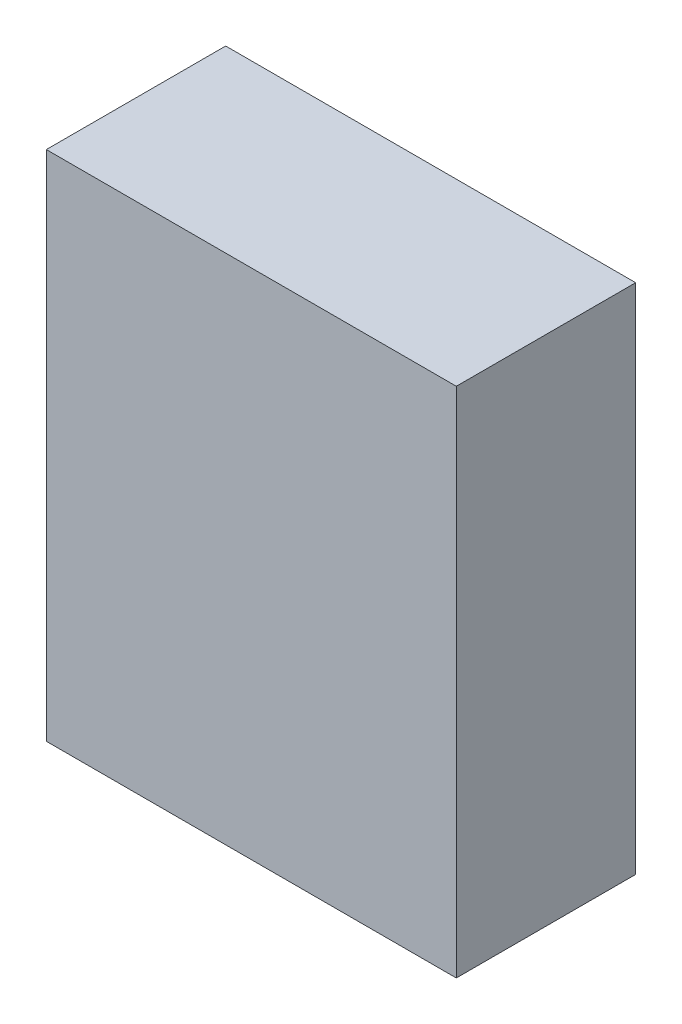
ISO-10303-21;
HEADER;
FILE_DESCRIPTION(('STEP AP214'),'2;1');
FILE_NAME('part.step','',(''),(''),'','','');
FILE_SCHEMA(('AUTOMOTIVE_DESIGN { 1 0 10303 214 1 1 1 1 }'));
ENDSEC;
DATA;
#1=APPLICATION_CONTEXT('core data for automotive mechanical design processes');
#2=APPLICATION_PROTOCOL_DEFINITION('international standard','automotive_design',2000,#1);
#3=PRODUCT_CONTEXT('',#1,'mechanical');
#4=PRODUCT('Part','Part','',(#3));
#5=PRODUCT_RELATED_PRODUCT_CATEGORY('part','',(#4));
#6=PRODUCT_DEFINITION_FORMATION('','',#4);
#7=PRODUCT_DEFINITION_CONTEXT('part definition',#1,'design');
#8=PRODUCT_DEFINITION('design','',#6,#7);
#9=PRODUCT_DEFINITION_SHAPE('','',#8);
#10=(LENGTH_UNIT() NAMED_UNIT(*) SI_UNIT(.MILLI.,.METRE.));
#11=(NAMED_UNIT(*) PLANE_ANGLE_UNIT() SI_UNIT($,.RADIAN.));
#12=(NAMED_UNIT(*) SI_UNIT($,.STERADIAN.) SOLID_ANGLE_UNIT());
#13=UNCERTAINTY_MEASURE_WITH_UNIT(LENGTH_MEASURE(1.E-05),#10,'distance_accuracy_value','');
#14=(GEOMETRIC_REPRESENTATION_CONTEXT(3) GLOBAL_UNCERTAINTY_ASSIGNED_CONTEXT((#13)) GLOBAL_UNIT_ASSIGNED_CONTEXT((#10,
#11,#12)) REPRESENTATION_CONTEXT('',''));
#15=CARTESIAN_POINT('',(0.,0.,0.));
#16=DIRECTION('',(0.,0.,1.));
#17=DIRECTION('',(1.,0.,0.));
#18=AXIS2_PLACEMENT_3D('',#15,#16,#17);
#19=CARTESIAN_POINT('',(2.00000108,-2.50000008,1.74999904));
#20=DIRECTION('',(0.,0.,1.));
#21=DIRECTION('',(1.,0.,0.));
#22=AXIS2_PLACEMENT_3D('',#19,#20,#21);
#23=PLANE('',#22);
#24=DIRECTION('',(0.,1.,0.));
#25=VECTOR('',#24,1.);
#26=CARTESIAN_POINT('',(-2.00000108,-2.50000008,1.74999904));
#27=LINE('',#26,#25);
#28=CARTESIAN_POINT('',(-2.00000108,-2.50000008,1.74999904));
#29=VERTEX_POINT('',#28);
#30=CARTESIAN_POINT('',(-2.00000108,2.50000008,1.74999904));
#31=VERTEX_POINT('',#30);
#32=EDGE_CURVE('E53',#29,#31,#27,.T.);
#33=ORIENTED_EDGE('',*,*,#32,.F.);
#34=DIRECTION('',(1.,0.,0.));
#35=VECTOR('',#34,1.);
#36=CARTESIAN_POINT('',(2.00000108,-2.50000008,1.74999904));
#37=LINE('',#36,#35);
#38=CARTESIAN_POINT('',(2.00000108,-2.50000008,1.74999904));
#39=VERTEX_POINT('',#38);
#40=EDGE_CURVE('E68',#39,#29,#37,.F.);
#41=ORIENTED_EDGE('',*,*,#40,.F.);
#42=DIRECTION('',(0.,1.,0.));
#43=VECTOR('',#42,1.);
#44=CARTESIAN_POINT('',(2.00000108,2.50000008,1.74999904));
#45=LINE('',#44,#43);
#46=CARTESIAN_POINT('',(2.00000108,2.50000008,1.74999904));
#47=VERTEX_POINT('',#46);
#48=EDGE_CURVE('E20',#47,#39,#45,.F.);
#49=ORIENTED_EDGE('',*,*,#48,.F.);
#50=DIRECTION('',(1.,0.,0.));
#51=VECTOR('',#50,1.);
#52=CARTESIAN_POINT('',(-2.00000108,2.50000008,1.74999904));
#53=LINE('',#52,#51);
#54=EDGE_CURVE('E58',#31,#47,#53,.T.);
#55=ORIENTED_EDGE('',*,*,#54,.F.);
#56=EDGE_LOOP('',(#33,#41,#49,#55));
#57=FACE_BOUND('',#56,.T.);
#58=ADVANCED_FACE('F17',(#57),#23,.T.);
#59=CARTESIAN_POINT('',(2.00000108,2.50000008,0.));
#60=DIRECTION('',(1.,0.,0.));
#61=DIRECTION('',(0.,0.,-1.));
#62=AXIS2_PLACEMENT_3D('',#59,#60,#61);
#63=PLANE('',#62);
#64=DIRECTION('',(0.,0.,-1.));
#65=VECTOR('',#64,1.);
#66=CARTESIAN_POINT('',(2.00000108,-2.50000008,0.));
#67=LINE('',#66,#65);
#68=CARTESIAN_POINT('',(2.00000108,-2.50000008,0.));
#69=VERTEX_POINT('',#68);
#70=EDGE_CURVE('E79',#69,#39,#67,.F.);
#71=ORIENTED_EDGE('',*,*,#70,.F.);
#72=DIRECTION('',(0.,1.,0.));
#73=VECTOR('',#72,1.);
#74=CARTESIAN_POINT('',(2.00000108,-2.50000008,0.));
#75=LINE('',#74,#73);
#76=CARTESIAN_POINT('',(2.00000108,2.50000008,0.));
#77=VERTEX_POINT('',#76);
#78=EDGE_CURVE('E74',#69,#77,#75,.T.);
#79=ORIENTED_EDGE('',*,*,#78,.T.);
#80=DIRECTION('',(0.,0.,1.));
#81=VECTOR('',#80,1.);
#82=CARTESIAN_POINT('',(2.00000108,2.50000008,0.));
#83=LINE('',#82,#81);
#84=EDGE_CURVE('E63',#47,#77,#83,.F.);
#85=ORIENTED_EDGE('',*,*,#84,.F.);
#86=ORIENTED_EDGE('',*,*,#48,.T.);
#87=EDGE_LOOP('',(#71,#79,#85,#86));
#88=FACE_BOUND('',#87,.T.);
#89=ADVANCED_FACE('F73',(#88),#63,.T.);
#90=CARTESIAN_POINT('',(-2.00000108,2.50000008,0.));
#91=DIRECTION('',(0.,1.,0.));
#92=DIRECTION('',(0.,0.,1.));
#93=AXIS2_PLACEMENT_3D('',#90,#91,#92);
#94=PLANE('',#93);
#95=ORIENTED_EDGE('',*,*,#84,.T.);
#96=DIRECTION('',(1.,0.,0.));
#97=VECTOR('',#96,1.);
#98=CARTESIAN_POINT('',(2.00000108,2.50000008,0.));
#99=LINE('',#98,#97);
#100=CARTESIAN_POINT('',(-2.00000108,2.50000008,0.));
#101=VERTEX_POINT('',#100);
#102=EDGE_CURVE('E84',#77,#101,#99,.F.);
#103=ORIENTED_EDGE('',*,*,#102,.T.);
#104=DIRECTION('',(0.,0.,1.));
#105=VECTOR('',#104,1.);
#106=CARTESIAN_POINT('',(-2.00000108,2.50000008,0.));
#107=LINE('',#106,#105);
#108=EDGE_CURVE('E65',#31,#101,#107,.F.);
#109=ORIENTED_EDGE('',*,*,#108,.F.);
#110=ORIENTED_EDGE('',*,*,#54,.T.);
#111=EDGE_LOOP('',(#95,#103,#109,#110));
#112=FACE_BOUND('',#111,.T.);
#113=ADVANCED_FACE('F60',(#112),#94,.T.);
#114=CARTESIAN_POINT('',(-2.00000108,-2.50000008,0.));
#115=DIRECTION('',(-1.,0.,0.));
#116=DIRECTION('',(0.,0.,1.));
#117=AXIS2_PLACEMENT_3D('',#114,#115,#116);
#118=PLANE('',#117);
#119=ORIENTED_EDGE('',*,*,#108,.T.);
#120=DIRECTION('',(0.,1.,0.));
#121=VECTOR('',#120,1.);
#122=CARTESIAN_POINT('',(-2.00000108,-2.50000008,0.));
#123=LINE('',#122,#121);
#124=CARTESIAN_POINT('',(-2.00000108,-2.50000008,0.));
#125=VERTEX_POINT('',#124);
#126=EDGE_CURVE('E26',#101,#125,#123,.F.);
#127=ORIENTED_EDGE('',*,*,#126,.T.);
#128=DIRECTION('',(0.,0.,-1.));
#129=VECTOR('',#128,1.);
#130=CARTESIAN_POINT('',(-2.00000108,-2.50000008,0.));
#131=LINE('',#130,#129);
#132=EDGE_CURVE('E34',#29,#125,#131,.T.);
#133=ORIENTED_EDGE('',*,*,#132,.F.);
#134=ORIENTED_EDGE('',*,*,#32,.T.);
#135=EDGE_LOOP('',(#119,#127,#133,#134));
#136=FACE_BOUND('',#135,.T.);
#137=ADVANCED_FACE('F88',(#136),#118,.T.);
#138=CARTESIAN_POINT('',(2.00000108,-2.50000008,0.));
#139=DIRECTION('',(0.,-1.,0.));
#140=DIRECTION('',(0.,0.,-1.));
#141=AXIS2_PLACEMENT_3D('',#138,#139,#140);
#142=PLANE('',#141);
#143=ORIENTED_EDGE('',*,*,#132,.T.);
#144=DIRECTION('',(1.,0.,0.));
#145=VECTOR('',#144,1.);
#146=CARTESIAN_POINT('',(2.00000108,-2.50000008,0.));
#147=LINE('',#146,#145);
#148=EDGE_CURVE('E11',#125,#69,#147,.T.);
#149=ORIENTED_EDGE('',*,*,#148,.T.);
#150=ORIENTED_EDGE('',*,*,#70,.T.);
#151=ORIENTED_EDGE('',*,*,#40,.T.);
#152=EDGE_LOOP('',(#143,#149,#150,#151));
#153=FACE_BOUND('',#152,.T.);
#154=ADVANCED_FACE('F91',(#153),#142,.T.);
#155=CARTESIAN_POINT('',(2.00000108,-2.50000008,0.));
#156=DIRECTION('',(0.,0.,1.));
#157=DIRECTION('',(1.,0.,0.));
#158=AXIS2_PLACEMENT_3D('',#155,#156,#157);
#159=PLANE('',#158);
#160=ORIENTED_EDGE('',*,*,#126,.F.);
#161=ORIENTED_EDGE('',*,*,#102,.F.);
#162=ORIENTED_EDGE('',*,*,#78,.F.);
#163=ORIENTED_EDGE('',*,*,#148,.F.);
#164=EDGE_LOOP('',(#160,#161,#162,#163));
#165=FACE_BOUND('',#164,.T.);
#166=ADVANCED_FACE('F90',(#165),#159,.F.);
#167=CLOSED_SHELL('',(#58,#89,#113,#137,#154,#166));
#168=MANIFOLD_SOLID_BREP('B1',#167);
#169=ADVANCED_BREP_SHAPE_REPRESENTATION('',(#18,#168),#14);
#170=SHAPE_DEFINITION_REPRESENTATION(#9,#169);
ENDSEC;
END-ISO-10303-21;
